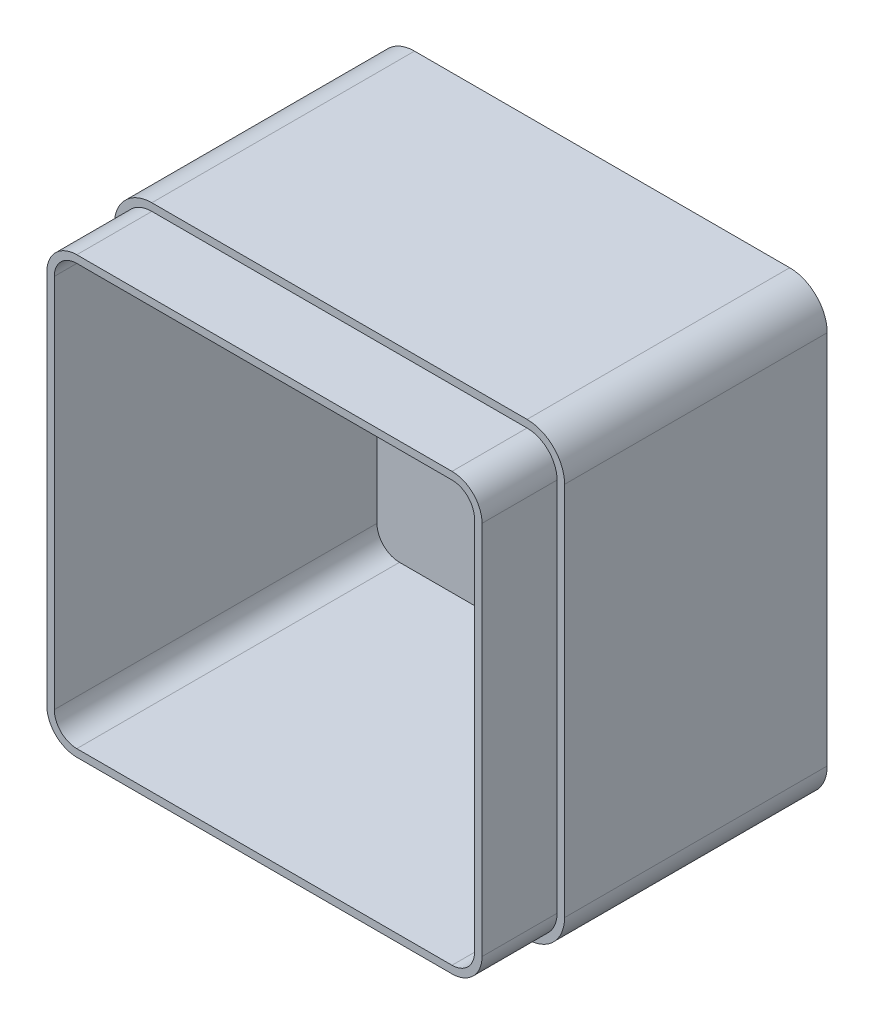
ISO-10303-21;
HEADER;
FILE_DESCRIPTION(('STEP AP214'),'2;1');
FILE_NAME('part.step','',(''),(''),'','','');
FILE_SCHEMA(('AUTOMOTIVE_DESIGN { 1 0 10303 214 1 1 1 1 }'));
ENDSEC;
DATA;
#1=APPLICATION_CONTEXT('core data for automotive mechanical design processes');
#2=APPLICATION_PROTOCOL_DEFINITION('international standard','automotive_design',2000,#1);
#3=PRODUCT_CONTEXT('',#1,'mechanical');
#4=PRODUCT('Part','Part','',(#3));
#5=PRODUCT_RELATED_PRODUCT_CATEGORY('part','',(#4));
#6=PRODUCT_DEFINITION_FORMATION('','',#4);
#7=PRODUCT_DEFINITION_CONTEXT('part definition',#1,'design');
#8=PRODUCT_DEFINITION('design','',#6,#7);
#9=PRODUCT_DEFINITION_SHAPE('','',#8);
#10=(LENGTH_UNIT() NAMED_UNIT(*) SI_UNIT(.MILLI.,.METRE.));
#11=(NAMED_UNIT(*) PLANE_ANGLE_UNIT() SI_UNIT($,.RADIAN.));
#12=(NAMED_UNIT(*) SI_UNIT($,.STERADIAN.) SOLID_ANGLE_UNIT());
#13=UNCERTAINTY_MEASURE_WITH_UNIT(LENGTH_MEASURE(1.E-05),#10,'distance_accuracy_value','');
#14=(GEOMETRIC_REPRESENTATION_CONTEXT(3) GLOBAL_UNCERTAINTY_ASSIGNED_CONTEXT((#13)) GLOBAL_UNIT_ASSIGNED_CONTEXT((#10,
#11,#12)) REPRESENTATION_CONTEXT('',''));
#15=CARTESIAN_POINT('',(0.,0.,0.));
#16=DIRECTION('',(0.,0.,1.));
#17=DIRECTION('',(1.,0.,0.));
#18=AXIS2_PLACEMENT_3D('',#15,#16,#17);
#19=CARTESIAN_POINT('',(0.,0.,90.));
#20=DIRECTION('',(0.,0.,1.));
#21=DIRECTION('',(1.,0.,0.));
#22=AXIS2_PLACEMENT_3D('',#19,#20,#21);
#23=PLANE('',#22);
#24=DIRECTION('',(0.,-1.,0.));
#25=VECTOR('',#24,1.);
#26=CARTESIAN_POINT('',(-25.769820971867,36.9820971867008,90.));
#27=LINE('',#26,#25);
#28=CARTESIAN_POINT('',(-25.769820971867,26.9820971867008,90.));
#29=VERTEX_POINT('',#28);
#30=CARTESIAN_POINT('',(-25.769820971867,-73.0179028132992,90.));
#31=VERTEX_POINT('',#30);
#32=EDGE_CURVE('E386',#29,#31,#27,.T.);
#33=ORIENTED_EDGE('',*,*,#32,.F.);
#34=CARTESIAN_POINT('',(-19.769820971867,26.9820971867008,90.));
#35=DIRECTION('',(0.,0.,1.));
#36=DIRECTION('',(1.,0.,0.));
#37=AXIS2_PLACEMENT_3D('',#34,#35,#36);
#38=CIRCLE('',#37,6.);
#39=CARTESIAN_POINT('',(-19.769820971867,32.9820971867008,90.));
#40=VERTEX_POINT('',#39);
#41=EDGE_CURVE('E432',#40,#29,#38,.T.);
#42=ORIENTED_EDGE('',*,*,#41,.F.);
#43=DIRECTION('',(-1.,0.,0.));
#44=VECTOR('',#43,1.);
#45=CARTESIAN_POINT('',(-29.769820971867,32.9820971867008,90.));
#46=LINE('',#45,#44);
#47=CARTESIAN_POINT('',(80.2301790281329,32.9820971867008,90.));
#48=VERTEX_POINT('',#47);
#49=EDGE_CURVE('E401',#48,#40,#46,.T.);
#50=ORIENTED_EDGE('',*,*,#49,.F.);
#51=CARTESIAN_POINT('',(80.230179028133,26.9820971867008,90.));
#52=DIRECTION('',(0.,0.,1.));
#53=DIRECTION('',(1.,0.,0.));
#54=AXIS2_PLACEMENT_3D('',#51,#52,#53);
#55=CIRCLE('',#54,6.);
#56=CARTESIAN_POINT('',(86.230179028133,26.9820971867008,90.));
#57=VERTEX_POINT('',#56);
#58=EDGE_CURVE('E365',#57,#48,#55,.T.);
#59=ORIENTED_EDGE('',*,*,#58,.F.);
#60=DIRECTION('',(0.,1.,0.));
#61=VECTOR('',#60,1.);
#62=CARTESIAN_POINT('',(86.230179028133,36.9820971867008,90.));
#63=LINE('',#62,#61);
#64=CARTESIAN_POINT('',(86.230179028133,-73.0179028132992,90.));
#65=VERTEX_POINT('',#64);
#66=EDGE_CURVE('E429',#65,#57,#63,.T.);
#67=ORIENTED_EDGE('',*,*,#66,.F.);
#68=CARTESIAN_POINT('',(80.230179028133,-73.0179028132992,90.));
#69=DIRECTION('',(0.,0.,1.));
#70=DIRECTION('',(1.,0.,0.));
#71=AXIS2_PLACEMENT_3D('',#68,#69,#70);
#72=CIRCLE('',#71,6.);
#73=CARTESIAN_POINT('',(80.2301790281329,-79.0179028132992,90.));
#74=VERTEX_POINT('',#73);
#75=EDGE_CURVE('E425',#74,#65,#72,.T.);
#76=ORIENTED_EDGE('',*,*,#75,.F.);
#77=DIRECTION('',(1.,0.,0.));
#78=VECTOR('',#77,1.);
#79=CARTESIAN_POINT('',(-29.769820971867,-79.0179028132992,90.));
#80=LINE('',#79,#78);
#81=CARTESIAN_POINT('',(-19.769820971867,-79.0179028132992,90.));
#82=VERTEX_POINT('',#81);
#83=EDGE_CURVE('E422',#82,#74,#80,.T.);
#84=ORIENTED_EDGE('',*,*,#83,.F.);
#85=CARTESIAN_POINT('',(-19.769820971867,-73.0179028132992,90.));
#86=DIRECTION('',(0.,0.,1.));
#87=DIRECTION('',(1.,0.,0.));
#88=AXIS2_PLACEMENT_3D('',#85,#86,#87);
#89=CIRCLE('',#88,6.);
#90=EDGE_CURVE('E410',#31,#82,#89,.T.);
#91=ORIENTED_EDGE('',*,*,#90,.F.);
#92=EDGE_LOOP('',(#33,#42,#50,#59,#67,#76,#84,#91));
#93=FACE_BOUND('',#92,.T.);
#94=DIRECTION('',(-1.,0.,0.));
#95=VECTOR('',#94,1.);
#96=CARTESIAN_POINT('',(80.230179028133,34.9820971867008,90.));
#97=LINE('',#96,#95);
#98=CARTESIAN_POINT('',(80.230179028133,34.9820971867008,90.));
#99=VERTEX_POINT('',#98);
#100=CARTESIAN_POINT('',(-19.769820971867,34.9820971867008,90.));
#101=VERTEX_POINT('',#100);
#102=EDGE_CURVE('E266',#99,#101,#97,.T.);
#103=ORIENTED_EDGE('',*,*,#102,.T.);
#104=CARTESIAN_POINT('',(-19.769820971867,26.9820971867008,90.));
#105=DIRECTION('',(0.,0.,1.));
#106=DIRECTION('',(1.,0.,0.));
#107=AXIS2_PLACEMENT_3D('',#104,#105,#106);
#108=CIRCLE('',#107,7.99999999999999);
#109=CARTESIAN_POINT('',(-27.769820971867,26.9820971867008,90.));
#110=VERTEX_POINT('',#109);
#111=EDGE_CURVE('E293',#101,#110,#108,.T.);
#112=ORIENTED_EDGE('',*,*,#111,.T.);
#113=DIRECTION('',(0.,-1.,0.));
#114=VECTOR('',#113,1.);
#115=CARTESIAN_POINT('',(-27.769820971867,26.9820971867008,90.));
#116=LINE('',#115,#114);
#117=CARTESIAN_POINT('',(-27.769820971867,-73.0179028132992,90.));
#118=VERTEX_POINT('',#117);
#119=EDGE_CURVE('E243',#110,#118,#116,.T.);
#120=ORIENTED_EDGE('',*,*,#119,.T.);
#121=CARTESIAN_POINT('',(-19.769820971867,-73.0179028132992,90.));
#122=DIRECTION('',(0.,0.,1.));
#123=DIRECTION('',(1.,0.,0.));
#124=AXIS2_PLACEMENT_3D('',#121,#122,#123);
#125=CIRCLE('',#124,8.);
#126=CARTESIAN_POINT('',(-19.769820971867,-81.0179028132992,90.));
#127=VERTEX_POINT('',#126);
#128=EDGE_CURVE('E92',#118,#127,#125,.T.);
#129=ORIENTED_EDGE('',*,*,#128,.T.);
#130=DIRECTION('',(1.,0.,0.));
#131=VECTOR('',#130,1.);
#132=CARTESIAN_POINT('',(-19.769820971867,-81.0179028132992,90.));
#133=LINE('',#132,#131);
#134=CARTESIAN_POINT('',(80.230179028133,-81.0179028132992,90.));
#135=VERTEX_POINT('',#134);
#136=EDGE_CURVE('E300',#127,#135,#133,.T.);
#137=ORIENTED_EDGE('',*,*,#136,.T.);
#138=CARTESIAN_POINT('',(80.230179028133,-73.0179028132992,90.));
#139=DIRECTION('',(0.,0.,1.));
#140=DIRECTION('',(1.,0.,0.));
#141=AXIS2_PLACEMENT_3D('',#138,#139,#140);
#142=CIRCLE('',#141,7.99999999999999);
#143=CARTESIAN_POINT('',(88.230179028133,-73.0179028132992,90.));
#144=VERTEX_POINT('',#143);
#145=EDGE_CURVE('E304',#135,#144,#142,.T.);
#146=ORIENTED_EDGE('',*,*,#145,.T.);
#147=DIRECTION('',(0.,1.,0.));
#148=VECTOR('',#147,1.);
#149=CARTESIAN_POINT('',(88.230179028133,-73.0179028132992,90.));
#150=LINE('',#149,#148);
#151=CARTESIAN_POINT('',(88.230179028133,26.9820971867008,90.));
#152=VERTEX_POINT('',#151);
#153=EDGE_CURVE('E308',#144,#152,#150,.T.);
#154=ORIENTED_EDGE('',*,*,#153,.T.);
#155=CARTESIAN_POINT('',(80.230179028133,26.9820971867008,90.));
#156=DIRECTION('',(0.,0.,1.));
#157=DIRECTION('',(1.,0.,0.));
#158=AXIS2_PLACEMENT_3D('',#155,#156,#157);
#159=CIRCLE('',#158,8.00000000000001);
#160=EDGE_CURVE('E270',#152,#99,#159,.T.);
#161=ORIENTED_EDGE('',*,*,#160,.T.);
#162=EDGE_LOOP('',(#103,#112,#120,#129,#137,#146,#154,#161));
#163=FACE_BOUND('',#162,.T.);
#164=ADVANCED_FACE('F76',(#93,#163),#23,.T.);
#165=CARTESIAN_POINT('',(-25.769820971867,36.9820971867008,90.));
#166=DIRECTION('',(1.,0.,0.));
#167=DIRECTION('',(0.,1.,0.));
#168=AXIS2_PLACEMENT_3D('',#165,#166,#167);
#169=PLANE('',#168);
#170=DIRECTION('',(0.,-1.,0.));
#171=VECTOR('',#170,1.);
#172=CARTESIAN_POINT('',(-25.769820971867,36.9820971867008,4.));
#173=LINE('',#172,#171);
#174=CARTESIAN_POINT('',(-25.769820971867,26.9820971867008,4.));
#175=VERTEX_POINT('',#174);
#176=CARTESIAN_POINT('',(-25.769820971867,-73.0179028132992,4.));
#177=VERTEX_POINT('',#176);
#178=EDGE_CURVE('E357',#175,#177,#173,.T.);
#179=ORIENTED_EDGE('',*,*,#178,.F.);
#180=DIRECTION('',(0.,0.,1.));
#181=VECTOR('',#180,1.);
#182=CARTESIAN_POINT('',(-25.769820971867,26.9820971867008,90.));
#183=LINE('',#182,#181);
#184=EDGE_CURVE('E366',#29,#175,#183,.F.);
#185=ORIENTED_EDGE('',*,*,#184,.F.);
#186=ORIENTED_EDGE('',*,*,#32,.T.);
#187=DIRECTION('',(0.,0.,1.));
#188=VECTOR('',#187,1.);
#189=CARTESIAN_POINT('',(-25.769820971867,-73.0179028132992,90.));
#190=LINE('',#189,#188);
#191=EDGE_CURVE('E362',#177,#31,#190,.T.);
#192=ORIENTED_EDGE('',*,*,#191,.F.);
#193=EDGE_LOOP('',(#179,#185,#186,#192));
#194=FACE_BOUND('',#193,.T.);
#195=ADVANCED_FACE('F541',(#194),#169,.T.);
#196=CARTESIAN_POINT('',(-29.769820971867,-79.0179028132992,90.));
#197=DIRECTION('',(0.,1.,0.));
#198=DIRECTION('',(0.,0.,1.));
#199=AXIS2_PLACEMENT_3D('',#196,#197,#198);
#200=PLANE('',#199);
#201=ORIENTED_EDGE('',*,*,#83,.T.);
#202=DIRECTION('',(0.,0.,1.));
#203=VECTOR('',#202,1.);
#204=CARTESIAN_POINT('',(80.2301790281329,-79.0179028132992,90.));
#205=LINE('',#204,#203);
#206=CARTESIAN_POINT('',(80.2301790281329,-79.0179028132992,4.));
#207=VERTEX_POINT('',#206);
#208=EDGE_CURVE('E398',#207,#74,#205,.T.);
#209=ORIENTED_EDGE('',*,*,#208,.F.);
#210=DIRECTION('',(1.,0.,0.));
#211=VECTOR('',#210,1.);
#212=CARTESIAN_POINT('',(-29.769820971867,-79.0179028132992,4.));
#213=LINE('',#212,#211);
#214=CARTESIAN_POINT('',(-19.769820971867,-79.0179028132992,4.));
#215=VERTEX_POINT('',#214);
#216=EDGE_CURVE('E361',#215,#207,#213,.T.);
#217=ORIENTED_EDGE('',*,*,#216,.F.);
#218=DIRECTION('',(0.,0.,1.));
#219=VECTOR('',#218,1.);
#220=CARTESIAN_POINT('',(-19.769820971867,-79.0179028132992,90.));
#221=LINE('',#220,#219);
#222=EDGE_CURVE('E389',#82,#215,#221,.F.);
#223=ORIENTED_EDGE('',*,*,#222,.F.);
#224=EDGE_LOOP('',(#201,#209,#217,#223));
#225=FACE_BOUND('',#224,.T.);
#226=ADVANCED_FACE('F546',(#225),#200,.T.);
#227=CARTESIAN_POINT('',(86.230179028133,36.9820971867008,90.));
#228=DIRECTION('',(-1.,0.,0.));
#229=DIRECTION('',(0.,-1.,0.));
#230=AXIS2_PLACEMENT_3D('',#227,#228,#229);
#231=PLANE('',#230);
#232=ORIENTED_EDGE('',*,*,#66,.T.);
#233=DIRECTION('',(0.,0.,1.));
#234=VECTOR('',#233,1.);
#235=CARTESIAN_POINT('',(86.230179028133,26.9820971867008,90.));
#236=LINE('',#235,#234);
#237=CARTESIAN_POINT('',(86.230179028133,26.9820971867008,4.));
#238=VERTEX_POINT('',#237);
#239=EDGE_CURVE('E407',#238,#57,#236,.T.);
#240=ORIENTED_EDGE('',*,*,#239,.F.);
#241=DIRECTION('',(0.,1.,0.));
#242=VECTOR('',#241,1.);
#243=CARTESIAN_POINT('',(86.230179028133,36.9820971867008,4.));
#244=LINE('',#243,#242);
#245=CARTESIAN_POINT('',(86.230179028133,-73.0179028132992,4.));
#246=VERTEX_POINT('',#245);
#247=EDGE_CURVE('E374',#246,#238,#244,.T.);
#248=ORIENTED_EDGE('',*,*,#247,.F.);
#249=DIRECTION('',(0.,0.,1.));
#250=VECTOR('',#249,1.);
#251=CARTESIAN_POINT('',(86.230179028133,-73.0179028132992,90.));
#252=LINE('',#251,#250);
#253=EDGE_CURVE('E402',#65,#246,#252,.F.);
#254=ORIENTED_EDGE('',*,*,#253,.F.);
#255=EDGE_LOOP('',(#232,#240,#248,#254));
#256=FACE_BOUND('',#255,.T.);
#257=ADVANCED_FACE('F575',(#256),#231,.T.);
#258=CARTESIAN_POINT('',(-29.769820971867,32.9820971867008,90.));
#259=DIRECTION('',(0.,-1.,0.));
#260=DIRECTION('',(0.,0.,-1.));
#261=AXIS2_PLACEMENT_3D('',#258,#259,#260);
#262=PLANE('',#261);
#263=DIRECTION('',(-1.,0.,0.));
#264=VECTOR('',#263,1.);
#265=CARTESIAN_POINT('',(-29.769820971867,32.9820971867008,4.));
#266=LINE('',#265,#264);
#267=CARTESIAN_POINT('',(80.2301790281329,32.9820971867008,4.));
#268=VERTEX_POINT('',#267);
#269=CARTESIAN_POINT('',(-19.769820971867,32.9820971867008,4.));
#270=VERTEX_POINT('',#269);
#271=EDGE_CURVE('E382',#268,#270,#266,.T.);
#272=ORIENTED_EDGE('',*,*,#271,.F.);
#273=DIRECTION('',(0.,0.,-1.));
#274=VECTOR('',#273,1.);
#275=CARTESIAN_POINT('',(80.2301790281329,32.9820971867008,90.));
#276=LINE('',#275,#274);
#277=EDGE_CURVE('E406',#48,#268,#276,.T.);
#278=ORIENTED_EDGE('',*,*,#277,.F.);
#279=ORIENTED_EDGE('',*,*,#49,.T.);
#280=DIRECTION('',(0.,0.,-1.));
#281=VECTOR('',#280,1.);
#282=CARTESIAN_POINT('',(-19.769820971867,32.9820971867008,90.));
#283=LINE('',#282,#281);
#284=EDGE_CURVE('E414',#270,#40,#283,.F.);
#285=ORIENTED_EDGE('',*,*,#284,.F.);
#286=EDGE_LOOP('',(#272,#278,#279,#285));
#287=FACE_BOUND('',#286,.T.);
#288=ADVANCED_FACE('F571',(#287),#262,.T.);
#289=CARTESIAN_POINT('',(0.,0.,4.));
#290=DIRECTION('',(0.,0.,1.));
#291=DIRECTION('',(1.,0.,0.));
#292=AXIS2_PLACEMENT_3D('',#289,#290,#291);
#293=PLANE('',#292);
#294=ORIENTED_EDGE('',*,*,#216,.T.);
#295=CARTESIAN_POINT('',(80.230179028133,-73.0179028132992,4.));
#296=DIRECTION('',(0.,0.,1.));
#297=DIRECTION('',(1.,0.,0.));
#298=AXIS2_PLACEMENT_3D('',#295,#296,#297);
#299=CIRCLE('',#298,6.);
#300=EDGE_CURVE('E377',#246,#207,#299,.F.);
#301=ORIENTED_EDGE('',*,*,#300,.F.);
#302=ORIENTED_EDGE('',*,*,#247,.T.);
#303=CARTESIAN_POINT('',(80.230179028133,26.9820971867008,4.));
#304=DIRECTION('',(0.,0.,1.));
#305=DIRECTION('',(1.,0.,0.));
#306=AXIS2_PLACEMENT_3D('',#303,#304,#305);
#307=CIRCLE('',#306,6.);
#308=EDGE_CURVE('E381',#268,#238,#307,.F.);
#309=ORIENTED_EDGE('',*,*,#308,.F.);
#310=ORIENTED_EDGE('',*,*,#271,.T.);
#311=CARTESIAN_POINT('',(-19.769820971867,26.9820971867008,4.));
#312=DIRECTION('',(0.,0.,1.));
#313=DIRECTION('',(1.,0.,0.));
#314=AXIS2_PLACEMENT_3D('',#311,#312,#313);
#315=CIRCLE('',#314,6.);
#316=EDGE_CURVE('E378',#175,#270,#315,.F.);
#317=ORIENTED_EDGE('',*,*,#316,.F.);
#318=ORIENTED_EDGE('',*,*,#178,.T.);
#319=CARTESIAN_POINT('',(-19.769820971867,-73.0179028132992,4.));
#320=DIRECTION('',(0.,0.,1.));
#321=DIRECTION('',(1.,0.,0.));
#322=AXIS2_PLACEMENT_3D('',#319,#320,#321);
#323=CIRCLE('',#322,6.);
#324=EDGE_CURVE('E370',#215,#177,#323,.F.);
#325=ORIENTED_EDGE('',*,*,#324,.F.);
#326=EDGE_LOOP('',(#294,#301,#302,#309,#310,#317,#318,#325));
#327=FACE_BOUND('',#326,.T.);
#328=ADVANCED_FACE('F567',(#327),#293,.T.);
#329=CARTESIAN_POINT('',(-19.769820971867,-73.0179028132992,90.));
#330=DIRECTION('',(0.,0.,-1.));
#331=DIRECTION('',(-1.,0.,0.));
#332=AXIS2_PLACEMENT_3D('',#329,#330,#331);
#333=CYLINDRICAL_SURFACE('',#332,6.);
#334=ORIENTED_EDGE('',*,*,#90,.T.);
#335=ORIENTED_EDGE('',*,*,#222,.T.);
#336=ORIENTED_EDGE('',*,*,#324,.T.);
#337=ORIENTED_EDGE('',*,*,#191,.T.);
#338=EDGE_LOOP('',(#334,#335,#336,#337));
#339=FACE_BOUND('',#338,.T.);
#340=ADVANCED_FACE('F563',(#339),#333,.F.);
#341=CARTESIAN_POINT('',(80.230179028133,-73.0179028132992,90.));
#342=DIRECTION('',(0.,0.,-1.));
#343=DIRECTION('',(-1.,0.,0.));
#344=AXIS2_PLACEMENT_3D('',#341,#342,#343);
#345=CYLINDRICAL_SURFACE('',#344,6.);
#346=ORIENTED_EDGE('',*,*,#75,.T.);
#347=ORIENTED_EDGE('',*,*,#253,.T.);
#348=ORIENTED_EDGE('',*,*,#300,.T.);
#349=ORIENTED_EDGE('',*,*,#208,.T.);
#350=EDGE_LOOP('',(#346,#347,#348,#349));
#351=FACE_BOUND('',#350,.T.);
#352=ADVANCED_FACE('F559',(#351),#345,.F.);
#353=CARTESIAN_POINT('',(-19.769820971867,26.9820971867008,90.));
#354=DIRECTION('',(0.,0.,-1.));
#355=DIRECTION('',(-1.,0.,0.));
#356=AXIS2_PLACEMENT_3D('',#353,#354,#355);
#357=CYLINDRICAL_SURFACE('',#356,6.);
#358=ORIENTED_EDGE('',*,*,#41,.T.);
#359=ORIENTED_EDGE('',*,*,#184,.T.);
#360=ORIENTED_EDGE('',*,*,#316,.T.);
#361=ORIENTED_EDGE('',*,*,#284,.T.);
#362=EDGE_LOOP('',(#358,#359,#360,#361));
#363=FACE_BOUND('',#362,.T.);
#364=ADVANCED_FACE('F555',(#363),#357,.F.);
#365=CARTESIAN_POINT('',(80.230179028133,26.9820971867008,90.));
#366=DIRECTION('',(0.,0.,-1.));
#367=DIRECTION('',(-1.,0.,0.));
#368=AXIS2_PLACEMENT_3D('',#365,#366,#367);
#369=CYLINDRICAL_SURFACE('',#368,6.);
#370=ORIENTED_EDGE('',*,*,#58,.T.);
#371=ORIENTED_EDGE('',*,*,#277,.T.);
#372=ORIENTED_EDGE('',*,*,#308,.T.);
#373=ORIENTED_EDGE('',*,*,#239,.T.);
#374=EDGE_LOOP('',(#370,#371,#372,#373));
#375=FACE_BOUND('',#374,.T.);
#376=ADVANCED_FACE('F552',(#375),#369,.F.);
#377=CARTESIAN_POINT('',(30.230179028133,-23.0179028132992,70.));
#378=DIRECTION('',(0.,0.,1.));
#379=DIRECTION('',(1.,0.,0.));
#380=AXIS2_PLACEMENT_3D('',#377,#378,#379);
#381=PLANE('',#380);
#382=DIRECTION('',(1.,0.,0.));
#383=VECTOR('',#382,1.);
#384=CARTESIAN_POINT('',(-29.769820971867,-83.0179028132992,70.));
#385=LINE('',#384,#383);
#386=CARTESIAN_POINT('',(-19.769820971867,-83.0179028132992,70.));
#387=VERTEX_POINT('',#386);
#388=CARTESIAN_POINT('',(80.230179028133,-83.0179028132992,70.));
#389=VERTEX_POINT('',#388);
#390=EDGE_CURVE('E347',#387,#389,#385,.T.);
#391=ORIENTED_EDGE('',*,*,#390,.T.);
#392=CARTESIAN_POINT('',(80.230179028133,-73.0179028132992,70.));
#393=DIRECTION('',(0.,0.,1.));
#394=DIRECTION('',(1.,0.,0.));
#395=AXIS2_PLACEMENT_3D('',#392,#393,#394);
#396=CIRCLE('',#395,10.);
#397=CARTESIAN_POINT('',(90.230179028133,-73.0179028132992,70.));
#398=VERTEX_POINT('',#397);
#399=EDGE_CURVE('E343',#398,#389,#396,.F.);
#400=ORIENTED_EDGE('',*,*,#399,.F.);
#401=DIRECTION('',(0.,1.,0.));
#402=VECTOR('',#401,1.);
#403=CARTESIAN_POINT('',(90.230179028133,36.9820971867008,70.));
#404=LINE('',#403,#402);
#405=CARTESIAN_POINT('',(90.230179028133,26.9820971867008,70.));
#406=VERTEX_POINT('',#405);
#407=EDGE_CURVE('E100',#398,#406,#404,.T.);
#408=ORIENTED_EDGE('',*,*,#407,.T.);
#409=CARTESIAN_POINT('',(80.230179028133,26.9820971867008,70.));
#410=DIRECTION('',(0.,0.,1.));
#411=DIRECTION('',(1.,0.,0.));
#412=AXIS2_PLACEMENT_3D('',#409,#410,#411);
#413=CIRCLE('',#412,10.);
#414=CARTESIAN_POINT('',(80.230179028133,36.9820971867008,70.));
#415=VERTEX_POINT('',#414);
#416=EDGE_CURVE('E13',#415,#406,#413,.F.);
#417=ORIENTED_EDGE('',*,*,#416,.F.);
#418=DIRECTION('',(-1.,0.,0.));
#419=VECTOR('',#418,1.);
#420=CARTESIAN_POINT('',(-29.769820971867,36.9820971867008,70.));
#421=LINE('',#420,#419);
#422=CARTESIAN_POINT('',(-19.769820971867,36.9820971867008,70.));
#423=VERTEX_POINT('',#422);
#424=EDGE_CURVE('E317',#415,#423,#421,.T.);
#425=ORIENTED_EDGE('',*,*,#424,.T.);
#426=CARTESIAN_POINT('',(-19.769820971867,26.9820971867008,70.));
#427=DIRECTION('',(0.,0.,1.));
#428=DIRECTION('',(1.,0.,0.));
#429=AXIS2_PLACEMENT_3D('',#426,#427,#428);
#430=CIRCLE('',#429,10.);
#431=CARTESIAN_POINT('',(-29.769820971867,26.9820971867008,70.));
#432=VERTEX_POINT('',#431);
#433=EDGE_CURVE('E339',#432,#423,#430,.F.);
#434=ORIENTED_EDGE('',*,*,#433,.F.);
#435=DIRECTION('',(0.,-1.,0.));
#436=VECTOR('',#435,1.);
#437=CARTESIAN_POINT('',(-29.769820971867,36.9820971867008,70.));
#438=LINE('',#437,#436);
#439=CARTESIAN_POINT('',(-29.769820971867,-73.0179028132992,70.));
#440=VERTEX_POINT('',#439);
#441=EDGE_CURVE('E350',#432,#440,#438,.T.);
#442=ORIENTED_EDGE('',*,*,#441,.T.);
#443=CARTESIAN_POINT('',(-19.769820971867,-73.0179028132992,70.));
#444=DIRECTION('',(0.,0.,1.));
#445=DIRECTION('',(1.,0.,0.));
#446=AXIS2_PLACEMENT_3D('',#443,#444,#445);
#447=CIRCLE('',#446,10.);
#448=EDGE_CURVE('E353',#387,#440,#447,.F.);
#449=ORIENTED_EDGE('',*,*,#448,.F.);
#450=EDGE_LOOP('',(#391,#400,#408,#417,#425,#434,#442,#449));
#451=FACE_BOUND('',#450,.T.);
#452=DIRECTION('',(-1.,0.,0.));
#453=VECTOR('',#452,1.);
#454=CARTESIAN_POINT('',(80.230179028133,34.9820971867008,70.));
#455=LINE('',#454,#453);
#456=CARTESIAN_POINT('',(80.230179028133,34.9820971867008,70.));
#457=VERTEX_POINT('',#456);
#458=CARTESIAN_POINT('',(-19.769820971867,34.9820971867008,70.));
#459=VERTEX_POINT('',#458);
#460=EDGE_CURVE('E250',#457,#459,#455,.T.);
#461=ORIENTED_EDGE('',*,*,#460,.F.);
#462=CARTESIAN_POINT('',(80.230179028133,26.9820971867008,70.));
#463=DIRECTION('',(0.,0.,1.));
#464=DIRECTION('',(1.,0.,0.));
#465=AXIS2_PLACEMENT_3D('',#462,#463,#464);
#466=CIRCLE('',#465,8.00000000000001);
#467=CARTESIAN_POINT('',(88.230179028133,26.9820971867008,70.));
#468=VERTEX_POINT('',#467);
#469=EDGE_CURVE('E287',#468,#457,#466,.T.);
#470=ORIENTED_EDGE('',*,*,#469,.F.);
#471=DIRECTION('',(0.,1.,0.));
#472=VECTOR('',#471,1.);
#473=CARTESIAN_POINT('',(88.230179028133,-73.0179028132992,70.));
#474=LINE('',#473,#472);
#475=CARTESIAN_POINT('',(88.230179028133,-73.0179028132992,70.));
#476=VERTEX_POINT('',#475);
#477=EDGE_CURVE('E283',#476,#468,#474,.T.);
#478=ORIENTED_EDGE('',*,*,#477,.F.);
#479=CARTESIAN_POINT('',(80.230179028133,-73.0179028132992,70.));
#480=DIRECTION('',(0.,0.,1.));
#481=DIRECTION('',(1.,0.,0.));
#482=AXIS2_PLACEMENT_3D('',#479,#480,#481);
#483=CIRCLE('',#482,7.99999999999999);
#484=CARTESIAN_POINT('',(80.230179028133,-81.0179028132992,70.));
#485=VERTEX_POINT('',#484);
#486=EDGE_CURVE('E279',#485,#476,#483,.T.);
#487=ORIENTED_EDGE('',*,*,#486,.F.);
#488=DIRECTION('',(1.,0.,0.));
#489=VECTOR('',#488,1.);
#490=CARTESIAN_POINT('',(-19.769820971867,-81.0179028132992,70.));
#491=LINE('',#490,#489);
#492=CARTESIAN_POINT('',(-19.769820971867,-81.0179028132992,70.));
#493=VERTEX_POINT('',#492);
#494=EDGE_CURVE('E275',#493,#485,#491,.T.);
#495=ORIENTED_EDGE('',*,*,#494,.F.);
#496=CARTESIAN_POINT('',(-19.769820971867,-73.0179028132992,70.));
#497=DIRECTION('',(0.,0.,1.));
#498=DIRECTION('',(1.,0.,0.));
#499=AXIS2_PLACEMENT_3D('',#496,#497,#498);
#500=CIRCLE('',#499,8.);
#501=CARTESIAN_POINT('',(-27.769820971867,-73.0179028132992,70.));
#502=VERTEX_POINT('',#501);
#503=EDGE_CURVE('E260',#502,#493,#500,.T.);
#504=ORIENTED_EDGE('',*,*,#503,.F.);
#505=DIRECTION('',(0.,-1.,0.));
#506=VECTOR('',#505,1.);
#507=CARTESIAN_POINT('',(-27.769820971867,26.9820971867008,70.));
#508=LINE('',#507,#506);
#509=CARTESIAN_POINT('',(-27.769820971867,26.9820971867008,70.));
#510=VERTEX_POINT('',#509);
#511=EDGE_CURVE('E241',#510,#502,#508,.T.);
#512=ORIENTED_EDGE('',*,*,#511,.F.);
#513=CARTESIAN_POINT('',(-19.769820971867,26.9820971867008,70.));
#514=DIRECTION('',(0.,0.,1.));
#515=DIRECTION('',(1.,0.,0.));
#516=AXIS2_PLACEMENT_3D('',#513,#514,#515);
#517=CIRCLE('',#516,7.99999999999999);
#518=EDGE_CURVE('E256',#459,#510,#517,.T.);
#519=ORIENTED_EDGE('',*,*,#518,.F.);
#520=EDGE_LOOP('',(#461,#470,#478,#487,#495,#504,#512,#519));
#521=FACE_BOUND('',#520,.T.);
#522=ADVANCED_FACE('F255',(#451,#521),#381,.T.);
#523=CARTESIAN_POINT('',(-19.769820971867,26.9820971867008,70.));
#524=DIRECTION('',(0.,0.,1.));
#525=DIRECTION('',(1.,0.,0.));
#526=AXIS2_PLACEMENT_3D('',#523,#524,#525);
#527=CYLINDRICAL_SURFACE('',#526,7.99999999999999);
#528=ORIENTED_EDGE('',*,*,#111,.F.);
#529=DIRECTION('',(0.,0.,1.));
#530=VECTOR('',#529,1.);
#531=CARTESIAN_POINT('',(-19.769820971867,34.9820971867008,70.));
#532=LINE('',#531,#530);
#533=EDGE_CURVE('E264',#459,#101,#532,.T.);
#534=ORIENTED_EDGE('',*,*,#533,.F.);
#535=ORIENTED_EDGE('',*,*,#518,.T.);
#536=DIRECTION('',(0.,0.,1.));
#537=VECTOR('',#536,1.);
#538=CARTESIAN_POINT('',(-27.769820971867,26.9820971867008,70.));
#539=LINE('',#538,#537);
#540=EDGE_CURVE('E238',#510,#110,#539,.T.);
#541=ORIENTED_EDGE('',*,*,#540,.T.);
#542=EDGE_LOOP('',(#528,#534,#535,#541));
#543=FACE_BOUND('',#542,.T.);
#544=ADVANCED_FACE('F263',(#543),#527,.T.);
#545=CARTESIAN_POINT('',(80.230179028133,34.9820971867008,70.));
#546=DIRECTION('',(0.,1.,0.));
#547=DIRECTION('',(0.,0.,1.));
#548=AXIS2_PLACEMENT_3D('',#545,#546,#547);
#549=PLANE('',#548);
#550=ORIENTED_EDGE('',*,*,#102,.F.);
#551=DIRECTION('',(0.,0.,1.));
#552=VECTOR('',#551,1.);
#553=CARTESIAN_POINT('',(80.230179028133,34.9820971867008,70.));
#554=LINE('',#553,#552);
#555=EDGE_CURVE('E318',#457,#99,#554,.T.);
#556=ORIENTED_EDGE('',*,*,#555,.F.);
#557=ORIENTED_EDGE('',*,*,#460,.T.);
#558=ORIENTED_EDGE('',*,*,#533,.T.);
#559=EDGE_LOOP('',(#550,#556,#557,#558));
#560=FACE_BOUND('',#559,.T.);
#561=ADVANCED_FACE('F586',(#560),#549,.T.);
#562=CARTESIAN_POINT('',(80.230179028133,26.9820971867008,70.));
#563=DIRECTION('',(0.,0.,1.));
#564=DIRECTION('',(1.,0.,0.));
#565=AXIS2_PLACEMENT_3D('',#562,#563,#564);
#566=CYLINDRICAL_SURFACE('',#565,8.00000000000001);
#567=ORIENTED_EDGE('',*,*,#160,.F.);
#568=DIRECTION('',(0.,0.,1.));
#569=VECTOR('',#568,1.);
#570=CARTESIAN_POINT('',(88.230179028133,26.9820971867008,70.));
#571=LINE('',#570,#569);
#572=EDGE_CURVE('E321',#468,#152,#571,.T.);
#573=ORIENTED_EDGE('',*,*,#572,.F.);
#574=ORIENTED_EDGE('',*,*,#469,.T.);
#575=ORIENTED_EDGE('',*,*,#555,.T.);
#576=EDGE_LOOP('',(#567,#573,#574,#575));
#577=FACE_BOUND('',#576,.T.);
#578=ADVANCED_FACE('F601',(#577),#566,.T.);
#579=CARTESIAN_POINT('',(88.230179028133,-73.0179028132992,70.));
#580=DIRECTION('',(1.,0.,0.));
#581=DIRECTION('',(0.,0.,-1.));
#582=AXIS2_PLACEMENT_3D('',#579,#580,#581);
#583=PLANE('',#582);
#584=ORIENTED_EDGE('',*,*,#153,.F.);
#585=DIRECTION('',(0.,0.,1.));
#586=VECTOR('',#585,1.);
#587=CARTESIAN_POINT('',(88.230179028133,-73.0179028132992,70.));
#588=LINE('',#587,#586);
#589=EDGE_CURVE('E324',#476,#144,#588,.T.);
#590=ORIENTED_EDGE('',*,*,#589,.F.);
#591=ORIENTED_EDGE('',*,*,#477,.T.);
#592=ORIENTED_EDGE('',*,*,#572,.T.);
#593=EDGE_LOOP('',(#584,#590,#591,#592));
#594=FACE_BOUND('',#593,.T.);
#595=ADVANCED_FACE('F597',(#594),#583,.T.);
#596=CARTESIAN_POINT('',(80.230179028133,-73.0179028132992,70.));
#597=DIRECTION('',(0.,0.,1.));
#598=DIRECTION('',(1.,0.,0.));
#599=AXIS2_PLACEMENT_3D('',#596,#597,#598);
#600=CYLINDRICAL_SURFACE('',#599,7.99999999999999);
#601=ORIENTED_EDGE('',*,*,#145,.F.);
#602=DIRECTION('',(0.,0.,1.));
#603=VECTOR('',#602,1.);
#604=CARTESIAN_POINT('',(80.230179028133,-81.0179028132992,70.));
#605=LINE('',#604,#603);
#606=EDGE_CURVE('E327',#485,#135,#605,.T.);
#607=ORIENTED_EDGE('',*,*,#606,.F.);
#608=ORIENTED_EDGE('',*,*,#486,.T.);
#609=ORIENTED_EDGE('',*,*,#589,.T.);
#610=EDGE_LOOP('',(#601,#607,#608,#609));
#611=FACE_BOUND('',#610,.T.);
#612=ADVANCED_FACE('F593',(#611),#600,.T.);
#613=CARTESIAN_POINT('',(-19.769820971867,-81.0179028132992,70.));
#614=DIRECTION('',(0.,-1.,0.));
#615=DIRECTION('',(0.,0.,-1.));
#616=AXIS2_PLACEMENT_3D('',#613,#614,#615);
#617=PLANE('',#616);
#618=ORIENTED_EDGE('',*,*,#136,.F.);
#619=DIRECTION('',(0.,0.,1.));
#620=VECTOR('',#619,1.);
#621=CARTESIAN_POINT('',(-19.769820971867,-81.0179028132992,70.));
#622=LINE('',#621,#620);
#623=EDGE_CURVE('E330',#493,#127,#622,.T.);
#624=ORIENTED_EDGE('',*,*,#623,.F.);
#625=ORIENTED_EDGE('',*,*,#494,.T.);
#626=ORIENTED_EDGE('',*,*,#606,.T.);
#627=EDGE_LOOP('',(#618,#624,#625,#626));
#628=FACE_BOUND('',#627,.T.);
#629=ADVANCED_FACE('F590',(#628),#617,.T.);
#630=CARTESIAN_POINT('',(-19.769820971867,-73.0179028132992,70.));
#631=DIRECTION('',(0.,0.,1.));
#632=DIRECTION('',(1.,0.,0.));
#633=AXIS2_PLACEMENT_3D('',#630,#631,#632);
#634=CYLINDRICAL_SURFACE('',#633,8.);
#635=ORIENTED_EDGE('',*,*,#128,.F.);
#636=DIRECTION('',(0.,0.,1.));
#637=VECTOR('',#636,1.);
#638=CARTESIAN_POINT('',(-27.769820971867,-73.0179028132992,70.));
#639=LINE('',#638,#637);
#640=EDGE_CURVE('E249',#502,#118,#639,.T.);
#641=ORIENTED_EDGE('',*,*,#640,.F.);
#642=ORIENTED_EDGE('',*,*,#503,.T.);
#643=ORIENTED_EDGE('',*,*,#623,.T.);
#644=EDGE_LOOP('',(#635,#641,#642,#643));
#645=FACE_BOUND('',#644,.T.);
#646=ADVANCED_FACE('F536',(#645),#634,.T.);
#647=CARTESIAN_POINT('',(-27.769820971867,26.9820971867008,70.));
#648=DIRECTION('',(-1.,0.,0.));
#649=DIRECTION('',(0.,0.,1.));
#650=AXIS2_PLACEMENT_3D('',#647,#648,#649);
#651=PLANE('',#650);
#652=ORIENTED_EDGE('',*,*,#119,.F.);
#653=ORIENTED_EDGE('',*,*,#540,.F.);
#654=ORIENTED_EDGE('',*,*,#511,.T.);
#655=ORIENTED_EDGE('',*,*,#640,.T.);
#656=EDGE_LOOP('',(#652,#653,#654,#655));
#657=FACE_BOUND('',#656,.T.);
#658=ADVANCED_FACE('F240',(#657),#651,.T.);
#659=CARTESIAN_POINT('',(0.,0.,0.));
#660=DIRECTION('',(0.,0.,1.));
#661=DIRECTION('',(1.,0.,0.));
#662=AXIS2_PLACEMENT_3D('',#659,#660,#661);
#663=PLANE('',#662);
#664=DIRECTION('',(1.,0.,0.));
#665=VECTOR('',#664,1.);
#666=CARTESIAN_POINT('',(-29.769820971867,-83.0179028132992,0.));
#667=LINE('',#666,#665);
#668=CARTESIAN_POINT('',(-19.769820971867,-83.0179028132992,0.));
#669=VERTEX_POINT('',#668);
#670=CARTESIAN_POINT('',(80.230179028133,-83.0179028132992,0.));
#671=VERTEX_POINT('',#670);
#672=EDGE_CURVE('E445',#669,#671,#667,.T.);
#673=ORIENTED_EDGE('',*,*,#672,.F.);
#674=CARTESIAN_POINT('',(-19.769820971867,-73.0179028132992,0.));
#675=DIRECTION('',(0.,0.,1.));
#676=DIRECTION('',(1.,0.,0.));
#677=AXIS2_PLACEMENT_3D('',#674,#675,#676);
#678=CIRCLE('',#677,10.);
#679=CARTESIAN_POINT('',(-29.769820971867,-73.0179028132992,0.));
#680=VERTEX_POINT('',#679);
#681=EDGE_CURVE('E473',#669,#680,#678,.F.);
#682=ORIENTED_EDGE('',*,*,#681,.T.);
#683=DIRECTION('',(0.,-1.,0.));
#684=VECTOR('',#683,1.);
#685=CARTESIAN_POINT('',(-29.769820971867,36.9820971867008,0.));
#686=LINE('',#685,#684);
#687=CARTESIAN_POINT('',(-29.769820971867,26.9820971867008,0.));
#688=VERTEX_POINT('',#687);
#689=EDGE_CURVE('E418',#688,#680,#686,.T.);
#690=ORIENTED_EDGE('',*,*,#689,.F.);
#691=CARTESIAN_POINT('',(-19.769820971867,26.9820971867008,0.));
#692=DIRECTION('',(0.,0.,1.));
#693=DIRECTION('',(1.,0.,0.));
#694=AXIS2_PLACEMENT_3D('',#691,#692,#693);
#695=CIRCLE('',#694,10.);
#696=CARTESIAN_POINT('',(-19.769820971867,36.9820971867008,0.));
#697=VERTEX_POINT('',#696);
#698=EDGE_CURVE('E467',#688,#697,#695,.F.);
#699=ORIENTED_EDGE('',*,*,#698,.T.);
#700=DIRECTION('',(-1.,0.,0.));
#701=VECTOR('',#700,1.);
#702=CARTESIAN_POINT('',(-29.769820971867,36.9820971867008,0.));
#703=LINE('',#702,#701);
#704=CARTESIAN_POINT('',(80.230179028133,36.9820971867008,0.));
#705=VERTEX_POINT('',#704);
#706=EDGE_CURVE('E453',#705,#697,#703,.T.);
#707=ORIENTED_EDGE('',*,*,#706,.F.);
#708=CARTESIAN_POINT('',(80.230179028133,26.9820971867008,0.));
#709=DIRECTION('',(0.,0.,1.));
#710=DIRECTION('',(1.,0.,0.));
#711=AXIS2_PLACEMENT_3D('',#708,#709,#710);
#712=CIRCLE('',#711,10.);
#713=CARTESIAN_POINT('',(90.230179028133,26.9820971867008,0.));
#714=VERTEX_POINT('',#713);
#715=EDGE_CURVE('E464',#705,#714,#712,.F.);
#716=ORIENTED_EDGE('',*,*,#715,.T.);
#717=DIRECTION('',(0.,1.,0.));
#718=VECTOR('',#717,1.);
#719=CARTESIAN_POINT('',(90.230179028133,36.9820971867008,0.));
#720=LINE('',#719,#718);
#721=CARTESIAN_POINT('',(90.230179028133,-73.0179028132992,0.));
#722=VERTEX_POINT('',#721);
#723=EDGE_CURVE('E449',#722,#714,#720,.T.);
#724=ORIENTED_EDGE('',*,*,#723,.F.);
#725=CARTESIAN_POINT('',(80.230179028133,-73.0179028132992,0.));
#726=DIRECTION('',(0.,0.,1.));
#727=DIRECTION('',(1.,0.,0.));
#728=AXIS2_PLACEMENT_3D('',#725,#726,#727);
#729=CIRCLE('',#728,10.);
#730=EDGE_CURVE('E470',#722,#671,#729,.F.);
#731=ORIENTED_EDGE('',*,*,#730,.T.);
#732=EDGE_LOOP('',(#673,#682,#690,#699,#707,#716,#724,#731));
#733=FACE_BOUND('',#732,.T.);
#734=ADVANCED_FACE('F529',(#733),#663,.F.);
#735=CARTESIAN_POINT('',(-19.769820971867,26.9820971867008,90.));
#736=DIRECTION('',(0.,0.,-1.));
#737=DIRECTION('',(-1.,0.,0.));
#738=AXIS2_PLACEMENT_3D('',#735,#736,#737);
#739=CYLINDRICAL_SURFACE('',#738,10.);
#740=DIRECTION('',(0.,0.,-1.));
#741=VECTOR('',#740,1.);
#742=CARTESIAN_POINT('',(-29.769820971867,26.9820971867008,90.));
#743=LINE('',#742,#741);
#744=EDGE_CURVE('E476',#432,#688,#743,.T.);
#745=ORIENTED_EDGE('',*,*,#744,.F.);
#746=ORIENTED_EDGE('',*,*,#433,.T.);
#747=DIRECTION('',(0.,0.,-1.));
#748=VECTOR('',#747,1.);
#749=CARTESIAN_POINT('',(-19.769820971867,36.9820971867008,90.));
#750=LINE('',#749,#748);
#751=EDGE_CURVE('E85',#697,#423,#750,.F.);
#752=ORIENTED_EDGE('',*,*,#751,.F.);
#753=ORIENTED_EDGE('',*,*,#698,.F.);
#754=EDGE_LOOP('',(#745,#746,#752,#753));
#755=FACE_BOUND('',#754,.T.);
#756=ADVANCED_FACE('F503',(#755),#739,.T.);
#757=CARTESIAN_POINT('',(80.230179028133,26.9820971867008,90.));
#758=DIRECTION('',(0.,0.,-1.));
#759=DIRECTION('',(-1.,0.,0.));
#760=AXIS2_PLACEMENT_3D('',#757,#758,#759);
#761=CYLINDRICAL_SURFACE('',#760,10.);
#762=DIRECTION('',(0.,0.,-1.));
#763=VECTOR('',#762,1.);
#764=CARTESIAN_POINT('',(80.230179028133,36.9820971867008,90.));
#765=LINE('',#764,#763);
#766=EDGE_CURVE('E490',#415,#705,#765,.T.);
#767=ORIENTED_EDGE('',*,*,#766,.F.);
#768=ORIENTED_EDGE('',*,*,#416,.T.);
#769=DIRECTION('',(0.,0.,-1.));
#770=VECTOR('',#769,1.);
#771=CARTESIAN_POINT('',(90.230179028133,26.9820971867008,90.));
#772=LINE('',#771,#770);
#773=EDGE_CURVE('E483',#714,#406,#772,.F.);
#774=ORIENTED_EDGE('',*,*,#773,.F.);
#775=ORIENTED_EDGE('',*,*,#715,.F.);
#776=EDGE_LOOP('',(#767,#768,#774,#775));
#777=FACE_BOUND('',#776,.T.);
#778=ADVANCED_FACE('F78',(#777),#761,.T.);
#779=CARTESIAN_POINT('',(-29.769820971867,36.9820971867008,90.));
#780=DIRECTION('',(0.,-1.,0.));
#781=DIRECTION('',(0.,0.,-1.));
#782=AXIS2_PLACEMENT_3D('',#779,#780,#781);
#783=PLANE('',#782);
#784=ORIENTED_EDGE('',*,*,#424,.F.);
#785=ORIENTED_EDGE('',*,*,#766,.T.);
#786=ORIENTED_EDGE('',*,*,#706,.T.);
#787=ORIENTED_EDGE('',*,*,#751,.T.);
#788=EDGE_LOOP('',(#784,#785,#786,#787));
#789=FACE_BOUND('',#788,.T.);
#790=ADVANCED_FACE('F497',(#789),#783,.F.);
#791=CARTESIAN_POINT('',(80.230179028133,-73.0179028132992,90.));
#792=DIRECTION('',(0.,0.,-1.));
#793=DIRECTION('',(-1.,0.,0.));
#794=AXIS2_PLACEMENT_3D('',#791,#792,#793);
#795=CYLINDRICAL_SURFACE('',#794,10.);
#796=DIRECTION('',(0.,0.,-1.));
#797=VECTOR('',#796,1.);
#798=CARTESIAN_POINT('',(90.230179028133,-73.0179028132992,90.));
#799=LINE('',#798,#797);
#800=EDGE_CURVE('E487',#398,#722,#799,.T.);
#801=ORIENTED_EDGE('',*,*,#800,.F.);
#802=ORIENTED_EDGE('',*,*,#399,.T.);
#803=DIRECTION('',(0.,0.,-1.));
#804=VECTOR('',#803,1.);
#805=CARTESIAN_POINT('',(80.230179028133,-83.0179028132992,90.));
#806=LINE('',#805,#804);
#807=EDGE_CURVE('E457',#671,#389,#806,.F.);
#808=ORIENTED_EDGE('',*,*,#807,.F.);
#809=ORIENTED_EDGE('',*,*,#730,.F.);
#810=EDGE_LOOP('',(#801,#802,#808,#809));
#811=FACE_BOUND('',#810,.T.);
#812=ADVANCED_FACE('F521',(#811),#795,.T.);
#813=CARTESIAN_POINT('',(90.230179028133,36.9820971867008,90.));
#814=DIRECTION('',(-1.,0.,0.));
#815=DIRECTION('',(0.,-1.,0.));
#816=AXIS2_PLACEMENT_3D('',#813,#814,#815);
#817=PLANE('',#816);
#818=ORIENTED_EDGE('',*,*,#407,.F.);
#819=ORIENTED_EDGE('',*,*,#800,.T.);
#820=ORIENTED_EDGE('',*,*,#723,.T.);
#821=ORIENTED_EDGE('',*,*,#773,.T.);
#822=EDGE_LOOP('',(#818,#819,#820,#821));
#823=FACE_BOUND('',#822,.T.);
#824=ADVANCED_FACE('F524',(#823),#817,.F.);
#825=CARTESIAN_POINT('',(-19.769820971867,-73.0179028132992,90.));
#826=DIRECTION('',(0.,0.,-1.));
#827=DIRECTION('',(-1.,0.,0.));
#828=AXIS2_PLACEMENT_3D('',#825,#826,#827);
#829=CYLINDRICAL_SURFACE('',#828,10.);
#830=DIRECTION('',(0.,0.,-1.));
#831=VECTOR('',#830,1.);
#832=CARTESIAN_POINT('',(-19.769820971867,-83.0179028132992,90.));
#833=LINE('',#832,#831);
#834=EDGE_CURVE('E461',#387,#669,#833,.T.);
#835=ORIENTED_EDGE('',*,*,#834,.F.);
#836=ORIENTED_EDGE('',*,*,#448,.T.);
#837=DIRECTION('',(0.,0.,-1.));
#838=VECTOR('',#837,1.);
#839=CARTESIAN_POINT('',(-29.769820971867,-73.0179028132992,90.));
#840=LINE('',#839,#838);
#841=EDGE_CURVE('E479',#680,#440,#840,.F.);
#842=ORIENTED_EDGE('',*,*,#841,.F.);
#843=ORIENTED_EDGE('',*,*,#681,.F.);
#844=EDGE_LOOP('',(#835,#836,#842,#843));
#845=FACE_BOUND('',#844,.T.);
#846=ADVANCED_FACE('F512',(#845),#829,.T.);
#847=CARTESIAN_POINT('',(-29.769820971867,-83.0179028132992,90.));
#848=DIRECTION('',(0.,1.,0.));
#849=DIRECTION('',(0.,0.,1.));
#850=AXIS2_PLACEMENT_3D('',#847,#848,#849);
#851=PLANE('',#850);
#852=ORIENTED_EDGE('',*,*,#390,.F.);
#853=ORIENTED_EDGE('',*,*,#834,.T.);
#854=ORIENTED_EDGE('',*,*,#672,.T.);
#855=ORIENTED_EDGE('',*,*,#807,.T.);
#856=EDGE_LOOP('',(#852,#853,#854,#855));
#857=FACE_BOUND('',#856,.T.);
#858=ADVANCED_FACE('F516',(#857),#851,.F.);
#859=CARTESIAN_POINT('',(-29.769820971867,36.9820971867008,90.));
#860=DIRECTION('',(1.,0.,0.));
#861=DIRECTION('',(0.,1.,0.));
#862=AXIS2_PLACEMENT_3D('',#859,#860,#861);
#863=PLANE('',#862);
#864=ORIENTED_EDGE('',*,*,#441,.F.);
#865=ORIENTED_EDGE('',*,*,#744,.T.);
#866=ORIENTED_EDGE('',*,*,#689,.T.);
#867=ORIENTED_EDGE('',*,*,#841,.T.);
#868=EDGE_LOOP('',(#864,#865,#866,#867));
#869=FACE_BOUND('',#868,.T.);
#870=ADVANCED_FACE('F507',(#869),#863,.F.);
#871=CLOSED_SHELL('',(#164,#195,#226,#257,#288,#328,#340,#352,#364,#376,#522,#544,#561,#578,
#595,#612,#629,#646,#658,#734,#756,#778,#790,#812,#824,#846,#858,#870));
#872=MANIFOLD_SOLID_BREP('B2',#871);
#873=ADVANCED_BREP_SHAPE_REPRESENTATION('',(#18,#872),#14);
#874=SHAPE_DEFINITION_REPRESENTATION(#9,#873);
ENDSEC;
END-ISO-10303-21;
